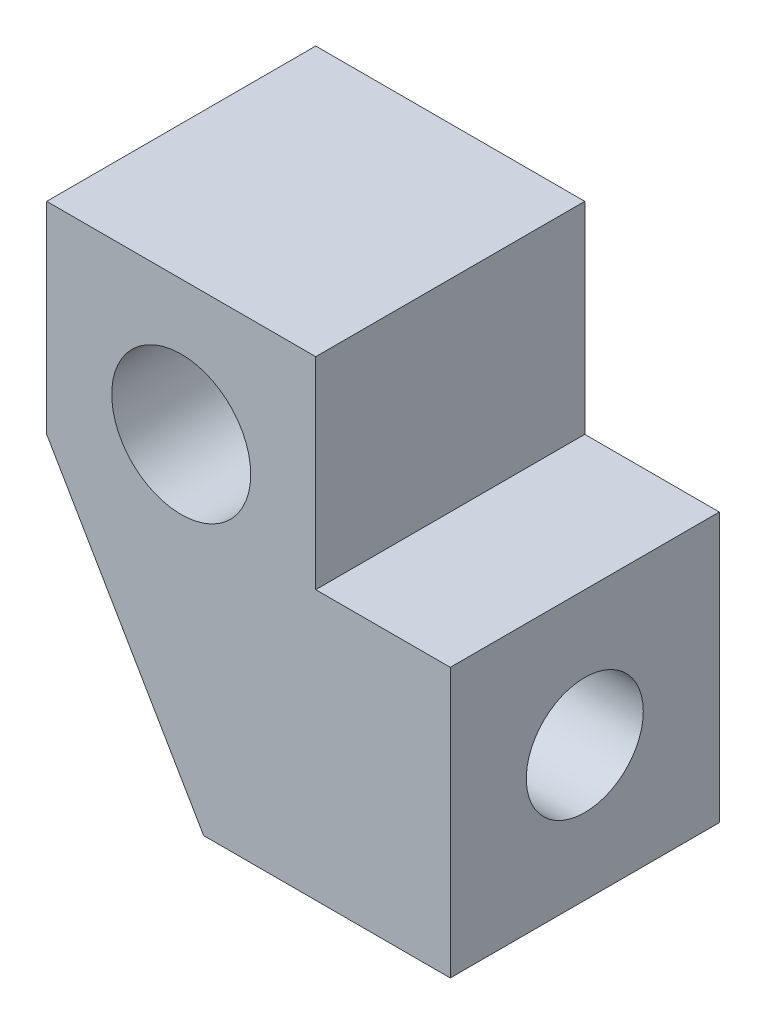
ISO-10303-21;
HEADER;
FILE_DESCRIPTION(('STEP AP214'),'2;1');
FILE_NAME('part.step','',(''),(''),'','','');
FILE_SCHEMA(('AUTOMOTIVE_DESIGN { 1 0 10303 214 1 1 1 1 }'));
ENDSEC;
DATA;
#1=APPLICATION_CONTEXT('core data for automotive mechanical design processes');
#2=APPLICATION_PROTOCOL_DEFINITION('international standard','automotive_design',2000,#1);
#3=PRODUCT_CONTEXT('',#1,'mechanical');
#4=PRODUCT('Part','Part','',(#3));
#5=PRODUCT_RELATED_PRODUCT_CATEGORY('part','',(#4));
#6=PRODUCT_DEFINITION_FORMATION('','',#4);
#7=PRODUCT_DEFINITION_CONTEXT('part definition',#1,'design');
#8=PRODUCT_DEFINITION('design','',#6,#7);
#9=PRODUCT_DEFINITION_SHAPE('','',#8);
#10=(LENGTH_UNIT() NAMED_UNIT(*) SI_UNIT(.MILLI.,.METRE.));
#11=(NAMED_UNIT(*) PLANE_ANGLE_UNIT() SI_UNIT($,.RADIAN.));
#12=(NAMED_UNIT(*) SI_UNIT($,.STERADIAN.) SOLID_ANGLE_UNIT());
#13=UNCERTAINTY_MEASURE_WITH_UNIT(LENGTH_MEASURE(1.E-05),#10,'distance_accuracy_value','');
#14=(GEOMETRIC_REPRESENTATION_CONTEXT(3) GLOBAL_UNCERTAINTY_ASSIGNED_CONTEXT((#13)) GLOBAL_UNIT_ASSIGNED_CONTEXT((#10,
#11,#12)) REPRESENTATION_CONTEXT('',''));
#15=CARTESIAN_POINT('',(0.,0.,0.));
#16=DIRECTION('',(0.,0.,1.));
#17=DIRECTION('',(1.,0.,0.));
#18=AXIS2_PLACEMENT_3D('',#15,#16,#17);
#19=CARTESIAN_POINT('',(0.,0.,6.));
#20=DIRECTION('',(0.,0.,1.));
#21=DIRECTION('',(1.,0.,0.));
#22=AXIS2_PLACEMENT_3D('',#19,#20,#21);
#23=PLANE('',#22);
#24=DIRECTION('',(0.,1.,0.));
#25=VECTOR('',#24,1.);
#26=CARTESIAN_POINT('',(48.,-44.,6.));
#27=LINE('',#26,#25);
#28=CARTESIAN_POINT('',(48.,-44.,6.));
#29=VERTEX_POINT('',#28);
#30=CARTESIAN_POINT('',(48.,-38.,6.));
#31=VERTEX_POINT('',#30);
#32=EDGE_CURVE('E156',#29,#31,#27,.T.);
#33=ORIENTED_EDGE('',*,*,#32,.T.);
#34=DIRECTION('',(-1.,0.,0.));
#35=VECTOR('',#34,1.);
#36=CARTESIAN_POINT('',(48.,-38.,6.));
#37=LINE('',#36,#35);
#38=CARTESIAN_POINT('',(45.,-38.,6.));
#39=VERTEX_POINT('',#38);
#40=EDGE_CURVE('E98',#31,#39,#37,.T.);
#41=ORIENTED_EDGE('',*,*,#40,.T.);
#42=DIRECTION('',(0.,1.,0.));
#43=VECTOR('',#42,1.);
#44=CARTESIAN_POINT('',(45.,-38.,6.));
#45=LINE('',#44,#43);
#46=CARTESIAN_POINT('',(45.,-33.5,6.));
#47=VERTEX_POINT('',#46);
#48=EDGE_CURVE('E174',#39,#47,#45,.T.);
#49=ORIENTED_EDGE('',*,*,#48,.T.);
#50=DIRECTION('',(-1.,0.,0.));
#51=VECTOR('',#50,1.);
#52=CARTESIAN_POINT('',(45.,-33.5,6.));
#53=LINE('',#52,#51);
#54=CARTESIAN_POINT('',(39.,-33.5,6.));
#55=VERTEX_POINT('',#54);
#56=EDGE_CURVE('E114',#47,#55,#53,.T.);
#57=ORIENTED_EDGE('',*,*,#56,.T.);
#58=DIRECTION('',(0.,-1.,0.));
#59=VECTOR('',#58,1.);
#60=CARTESIAN_POINT('',(39.,-33.5,6.));
#61=LINE('',#60,#59);
#62=CARTESIAN_POINT('',(39.,-38.,6.));
#63=VERTEX_POINT('',#62);
#64=EDGE_CURVE('E108',#55,#63,#61,.T.);
#65=ORIENTED_EDGE('',*,*,#64,.T.);
#66=DIRECTION('',(0.503871025524086,-0.863778900898434,0.));
#67=VECTOR('',#66,1.);
#68=CARTESIAN_POINT('',(39.,-38.,6.));
#69=LINE('',#68,#67);
#70=CARTESIAN_POINT('',(42.5,-44.,6.));
#71=VERTEX_POINT('',#70);
#72=EDGE_CURVE('E112',#63,#71,#69,.T.);
#73=ORIENTED_EDGE('',*,*,#72,.T.);
#74=DIRECTION('',(1.,0.,0.));
#75=VECTOR('',#74,1.);
#76=CARTESIAN_POINT('',(42.5,-44.,6.));
#77=LINE('',#76,#75);
#78=EDGE_CURVE('E58',#71,#29,#77,.T.);
#79=ORIENTED_EDGE('',*,*,#78,.T.);
#80=EDGE_LOOP('',(#33,#41,#49,#57,#65,#73,#79));
#81=FACE_BOUND('',#80,.T.);
#82=CARTESIAN_POINT('',(42.,-36.5,6.));
#83=DIRECTION('',(0.,0.,1.));
#84=DIRECTION('',(1.,0.,0.));
#85=AXIS2_PLACEMENT_3D('',#82,#83,#84);
#86=CIRCLE('',#85,1.55);
#87=CARTESIAN_POINT('',(43.55,-36.5,6.));
#88=VERTEX_POINT('',#87);
#89=EDGE_CURVE('E141',#88,#88,#86,.T.);
#90=ORIENTED_EDGE('',*,*,#89,.F.);
#91=EDGE_LOOP('',(#90));
#92=FACE_BOUND('',#91,.T.);
#93=ADVANCED_FACE('F39',(#81,#92),#23,.T.);
#94=CARTESIAN_POINT('',(0.,0.,0.));
#95=DIRECTION('',(0.,0.,1.));
#96=DIRECTION('',(1.,0.,0.));
#97=AXIS2_PLACEMENT_3D('',#94,#95,#96);
#98=PLANE('',#97);
#99=DIRECTION('',(0.,1.,0.));
#100=VECTOR('',#99,1.);
#101=CARTESIAN_POINT('',(48.,-44.,0.));
#102=LINE('',#101,#100);
#103=CARTESIAN_POINT('',(48.,-44.,0.));
#104=VERTEX_POINT('',#103);
#105=CARTESIAN_POINT('',(48.,-38.,0.));
#106=VERTEX_POINT('',#105);
#107=EDGE_CURVE('E136',#104,#106,#102,.T.);
#108=ORIENTED_EDGE('',*,*,#107,.F.);
#109=DIRECTION('',(1.,0.,0.));
#110=VECTOR('',#109,1.);
#111=CARTESIAN_POINT('',(42.5,-44.,0.));
#112=LINE('',#111,#110);
#113=CARTESIAN_POINT('',(42.5,-44.,0.));
#114=VERTEX_POINT('',#113);
#115=EDGE_CURVE('E90',#114,#104,#112,.T.);
#116=ORIENTED_EDGE('',*,*,#115,.F.);
#117=DIRECTION('',(0.503871025524086,-0.863778900898434,0.));
#118=VECTOR('',#117,1.);
#119=CARTESIAN_POINT('',(39.,-38.,0.));
#120=LINE('',#119,#118);
#121=CARTESIAN_POINT('',(39.,-38.,0.));
#122=VERTEX_POINT('',#121);
#123=EDGE_CURVE('E84',#122,#114,#120,.T.);
#124=ORIENTED_EDGE('',*,*,#123,.F.);
#125=DIRECTION('',(0.,-1.,0.));
#126=VECTOR('',#125,1.);
#127=CARTESIAN_POINT('',(39.,-33.5,0.));
#128=LINE('',#127,#126);
#129=CARTESIAN_POINT('',(39.,-33.5,0.));
#130=VERTEX_POINT('',#129);
#131=EDGE_CURVE('E123',#130,#122,#128,.T.);
#132=ORIENTED_EDGE('',*,*,#131,.F.);
#133=DIRECTION('',(-1.,0.,0.));
#134=VECTOR('',#133,1.);
#135=CARTESIAN_POINT('',(45.,-33.5,0.));
#136=LINE('',#135,#134);
#137=CARTESIAN_POINT('',(45.,-33.5,0.));
#138=VERTEX_POINT('',#137);
#139=EDGE_CURVE('E147',#138,#130,#136,.T.);
#140=ORIENTED_EDGE('',*,*,#139,.F.);
#141=DIRECTION('',(0.,1.,0.));
#142=VECTOR('',#141,1.);
#143=CARTESIAN_POINT('',(45.,-38.,0.));
#144=LINE('',#143,#142);
#145=CARTESIAN_POINT('',(45.,-38.,0.));
#146=VERTEX_POINT('',#145);
#147=EDGE_CURVE('E144',#146,#138,#144,.T.);
#148=ORIENTED_EDGE('',*,*,#147,.F.);
#149=DIRECTION('',(-1.,0.,0.));
#150=VECTOR('',#149,1.);
#151=CARTESIAN_POINT('',(48.,-38.,0.));
#152=LINE('',#151,#150);
#153=EDGE_CURVE('E140',#106,#146,#152,.T.);
#154=ORIENTED_EDGE('',*,*,#153,.F.);
#155=EDGE_LOOP('',(#108,#116,#124,#132,#140,#148,#154));
#156=FACE_BOUND('',#155,.T.);
#157=CARTESIAN_POINT('',(42.,-36.5,0.));
#158=DIRECTION('',(0.,0.,1.));
#159=DIRECTION('',(1.,0.,0.));
#160=AXIS2_PLACEMENT_3D('',#157,#158,#159);
#161=CIRCLE('',#160,1.55);
#162=CARTESIAN_POINT('',(43.55,-36.5,0.));
#163=VERTEX_POINT('',#162);
#164=EDGE_CURVE('E190',#163,#163,#161,.T.);
#165=ORIENTED_EDGE('',*,*,#164,.T.);
#166=EDGE_LOOP('',(#165));
#167=FACE_BOUND('',#166,.T.);
#168=ADVANCED_FACE('F178',(#156,#167),#98,.F.);
#169=CARTESIAN_POINT('',(48.,-44.,6.));
#170=DIRECTION('',(-1.,0.,0.));
#171=DIRECTION('',(0.,0.,1.));
#172=AXIS2_PLACEMENT_3D('',#169,#170,#171);
#173=PLANE('',#172);
#174=CARTESIAN_POINT('',(48.,-41.,3.));
#175=DIRECTION('',(1.,0.,0.));
#176=DIRECTION('',(0.,0.,-1.));
#177=AXIS2_PLACEMENT_3D('',#174,#175,#176);
#178=CIRCLE('',#177,1.305);
#179=CARTESIAN_POINT('',(48.,-41.,1.695));
#180=VERTEX_POINT('',#179);
#181=EDGE_CURVE('E197',#180,#180,#178,.T.);
#182=ORIENTED_EDGE('',*,*,#181,.F.);
#183=EDGE_LOOP('',(#182));
#184=FACE_BOUND('',#183,.T.);
#185=ORIENTED_EDGE('',*,*,#107,.T.);
#186=DIRECTION('',(0.,0.,-1.));
#187=VECTOR('',#186,1.);
#188=CARTESIAN_POINT('',(48.,-38.,6.));
#189=LINE('',#188,#187);
#190=EDGE_CURVE('E11',#31,#106,#189,.T.);
#191=ORIENTED_EDGE('',*,*,#190,.F.);
#192=ORIENTED_EDGE('',*,*,#32,.F.);
#193=DIRECTION('',(0.,0.,-1.));
#194=VECTOR('',#193,1.);
#195=CARTESIAN_POINT('',(48.,-44.,6.));
#196=LINE('',#195,#194);
#197=EDGE_CURVE('E132',#29,#104,#196,.T.);
#198=ORIENTED_EDGE('',*,*,#197,.T.);
#199=EDGE_LOOP('',(#185,#191,#192,#198));
#200=FACE_BOUND('',#199,.T.);
#201=ADVANCED_FACE('F41',(#184,#200),#173,.F.);
#202=CARTESIAN_POINT('',(48.,-38.,6.));
#203=DIRECTION('',(0.,-1.,0.));
#204=DIRECTION('',(0.,0.,-1.));
#205=AXIS2_PLACEMENT_3D('',#202,#203,#204);
#206=PLANE('',#205);
#207=ORIENTED_EDGE('',*,*,#153,.T.);
#208=DIRECTION('',(0.,0.,-1.));
#209=VECTOR('',#208,1.);
#210=CARTESIAN_POINT('',(45.,-38.,6.));
#211=LINE('',#210,#209);
#212=EDGE_CURVE('E50',#39,#146,#211,.T.);
#213=ORIENTED_EDGE('',*,*,#212,.F.);
#214=ORIENTED_EDGE('',*,*,#40,.F.);
#215=ORIENTED_EDGE('',*,*,#190,.T.);
#216=EDGE_LOOP('',(#207,#213,#214,#215));
#217=FACE_BOUND('',#216,.T.);
#218=ADVANCED_FACE('F233',(#217),#206,.F.);
#219=CARTESIAN_POINT('',(45.,-38.,6.));
#220=DIRECTION('',(-1.,0.,0.));
#221=DIRECTION('',(0.,0.,1.));
#222=AXIS2_PLACEMENT_3D('',#219,#220,#221);
#223=PLANE('',#222);
#224=ORIENTED_EDGE('',*,*,#147,.T.);
#225=DIRECTION('',(0.,0.,-1.));
#226=VECTOR('',#225,1.);
#227=CARTESIAN_POINT('',(45.,-33.5,6.));
#228=LINE('',#227,#226);
#229=EDGE_CURVE('E163',#47,#138,#228,.T.);
#230=ORIENTED_EDGE('',*,*,#229,.F.);
#231=ORIENTED_EDGE('',*,*,#48,.F.);
#232=ORIENTED_EDGE('',*,*,#212,.T.);
#233=EDGE_LOOP('',(#224,#230,#231,#232));
#234=FACE_BOUND('',#233,.T.);
#235=ADVANCED_FACE('F172',(#234),#223,.F.);
#236=CARTESIAN_POINT('',(45.,-33.5,6.));
#237=DIRECTION('',(0.,-1.,0.));
#238=DIRECTION('',(0.,0.,-1.));
#239=AXIS2_PLACEMENT_3D('',#236,#237,#238);
#240=PLANE('',#239);
#241=ORIENTED_EDGE('',*,*,#139,.T.);
#242=DIRECTION('',(0.,0.,-1.));
#243=VECTOR('',#242,1.);
#244=CARTESIAN_POINT('',(39.,-33.5,6.));
#245=LINE('',#244,#243);
#246=EDGE_CURVE('E125',#55,#130,#245,.T.);
#247=ORIENTED_EDGE('',*,*,#246,.F.);
#248=ORIENTED_EDGE('',*,*,#56,.F.);
#249=ORIENTED_EDGE('',*,*,#229,.T.);
#250=EDGE_LOOP('',(#241,#247,#248,#249));
#251=FACE_BOUND('',#250,.T.);
#252=ADVANCED_FACE('F181',(#251),#240,.F.);
#253=CARTESIAN_POINT('',(39.,-33.5,6.));
#254=DIRECTION('',(1.,0.,0.));
#255=DIRECTION('',(0.,1.,0.));
#256=AXIS2_PLACEMENT_3D('',#253,#254,#255);
#257=PLANE('',#256);
#258=ORIENTED_EDGE('',*,*,#131,.T.);
#259=DIRECTION('',(0.,0.,-1.));
#260=VECTOR('',#259,1.);
#261=CARTESIAN_POINT('',(39.,-38.,6.));
#262=LINE('',#261,#260);
#263=EDGE_CURVE('E120',#63,#122,#262,.T.);
#264=ORIENTED_EDGE('',*,*,#263,.F.);
#265=ORIENTED_EDGE('',*,*,#64,.F.);
#266=ORIENTED_EDGE('',*,*,#246,.T.);
#267=EDGE_LOOP('',(#258,#264,#265,#266));
#268=FACE_BOUND('',#267,.T.);
#269=ADVANCED_FACE('F121',(#268),#257,.F.);
#270=CARTESIAN_POINT('',(39.,-38.,6.));
#271=DIRECTION('',(0.863778900898433,0.503871025524086,0.));
#272=DIRECTION('',(-0.503871025524086,0.863778900898434,0.));
#273=AXIS2_PLACEMENT_3D('',#270,#271,#272);
#274=PLANE('',#273);
#275=CARTESIAN_POINT('',(40.75,-41.,3.));
#276=DIRECTION('',(0.863778900898433,0.503871025524086,0.));
#277=DIRECTION('',(0.503871025524086,-0.863778900898434,0.));
#278=AXIS2_PLACEMENT_3D('',#275,#276,#277);
#279=ELLIPSE('',#278,1.51080328385267,1.305);
#280=CARTESIAN_POINT('',(41.51125,-42.305,3.));
#281=VERTEX_POINT('',#280);
#282=EDGE_CURVE('E43',#281,#281,#279,.T.);
#283=ORIENTED_EDGE('',*,*,#282,.T.);
#284=EDGE_LOOP('',(#283));
#285=FACE_BOUND('',#284,.T.);
#286=ORIENTED_EDGE('',*,*,#123,.T.);
#287=DIRECTION('',(0.,0.,-1.));
#288=VECTOR('',#287,1.);
#289=CARTESIAN_POINT('',(42.5,-44.,6.));
#290=LINE('',#289,#288);
#291=EDGE_CURVE('E126',#71,#114,#290,.T.);
#292=ORIENTED_EDGE('',*,*,#291,.F.);
#293=ORIENTED_EDGE('',*,*,#72,.F.);
#294=ORIENTED_EDGE('',*,*,#263,.T.);
#295=EDGE_LOOP('',(#286,#292,#293,#294));
#296=FACE_BOUND('',#295,.T.);
#297=ADVANCED_FACE('F128',(#285,#296),#274,.F.);
#298=CARTESIAN_POINT('',(42.5,-44.,6.));
#299=DIRECTION('',(0.,1.,0.));
#300=DIRECTION('',(0.,0.,1.));
#301=AXIS2_PLACEMENT_3D('',#298,#299,#300);
#302=PLANE('',#301);
#303=ORIENTED_EDGE('',*,*,#115,.T.);
#304=ORIENTED_EDGE('',*,*,#197,.F.);
#305=ORIENTED_EDGE('',*,*,#78,.F.);
#306=ORIENTED_EDGE('',*,*,#291,.T.);
#307=EDGE_LOOP('',(#303,#304,#305,#306));
#308=FACE_BOUND('',#307,.T.);
#309=ADVANCED_FACE('F214',(#308),#302,.F.);
#310=CARTESIAN_POINT('',(42.,-36.5,6.));
#311=DIRECTION('',(0.,0.,-1.));
#312=DIRECTION('',(-1.,0.,0.));
#313=AXIS2_PLACEMENT_3D('',#310,#311,#312);
#314=CYLINDRICAL_SURFACE('',#313,1.55);
#315=ORIENTED_EDGE('',*,*,#89,.T.);
#316=EDGE_LOOP('',(#315));
#317=FACE_BOUND('',#316,.T.);
#318=ORIENTED_EDGE('',*,*,#164,.F.);
#319=EDGE_LOOP('',(#318));
#320=FACE_BOUND('',#319,.T.);
#321=ADVANCED_FACE('F209',(#317,#320),#314,.F.);
#322=CARTESIAN_POINT('',(39.,-41.,3.));
#323=DIRECTION('',(1.,0.,0.));
#324=DIRECTION('',(0.,0.,-1.));
#325=AXIS2_PLACEMENT_3D('',#322,#323,#324);
#326=CYLINDRICAL_SURFACE('',#325,1.305);
#327=ORIENTED_EDGE('',*,*,#181,.T.);
#328=EDGE_LOOP('',(#327));
#329=FACE_BOUND('',#328,.T.);
#330=ORIENTED_EDGE('',*,*,#282,.F.);
#331=EDGE_LOOP('',(#330));
#332=FACE_BOUND('',#331,.T.);
#333=ADVANCED_FACE('F207',(#329,#332),#326,.F.);
#334=CLOSED_SHELL('',(#93,#168,#201,#218,#235,#252,#269,#297,#309,#321,#333));
#335=MANIFOLD_SOLID_BREP('B2',#334);
#336=ADVANCED_BREP_SHAPE_REPRESENTATION('',(#18,#335),#14);
#337=SHAPE_DEFINITION_REPRESENTATION(#9,#336);
ENDSEC;
END-ISO-10303-21;
